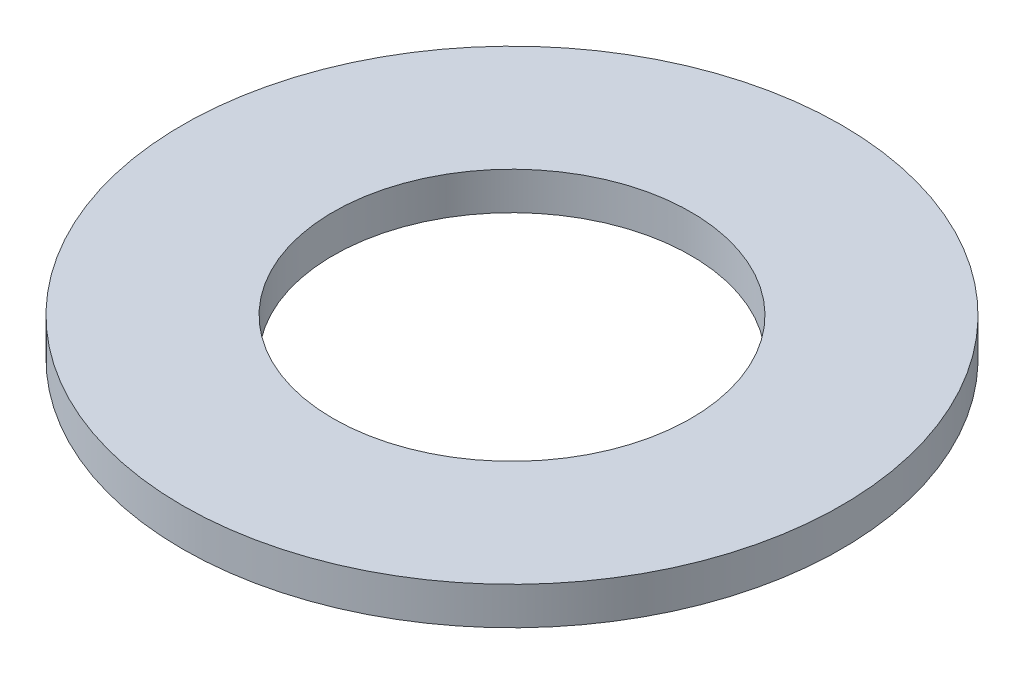
ISO-10303-21;
HEADER;
FILE_DESCRIPTION(('STEP AP214'),'2;1');
FILE_NAME('part.step','',(''),(''),'','','');
FILE_SCHEMA(('AUTOMOTIVE_DESIGN { 1 0 10303 214 1 1 1 1 }'));
ENDSEC;
DATA;
#1=APPLICATION_CONTEXT('core data for automotive mechanical design processes');
#2=APPLICATION_PROTOCOL_DEFINITION('international standard','automotive_design',2000,#1);
#3=PRODUCT_CONTEXT('',#1,'mechanical');
#4=PRODUCT('Part','Part','',(#3));
#5=PRODUCT_RELATED_PRODUCT_CATEGORY('part','',(#4));
#6=PRODUCT_DEFINITION_FORMATION('','',#4);
#7=PRODUCT_DEFINITION_CONTEXT('part definition',#1,'design');
#8=PRODUCT_DEFINITION('design','',#6,#7);
#9=PRODUCT_DEFINITION_SHAPE('','',#8);
#10=(LENGTH_UNIT() NAMED_UNIT(*) SI_UNIT(.MILLI.,.METRE.));
#11=(NAMED_UNIT(*) PLANE_ANGLE_UNIT() SI_UNIT($,.RADIAN.));
#12=(NAMED_UNIT(*) SI_UNIT($,.STERADIAN.) SOLID_ANGLE_UNIT());
#13=UNCERTAINTY_MEASURE_WITH_UNIT(LENGTH_MEASURE(1.E-05),#10,'distance_accuracy_value','');
#14=(GEOMETRIC_REPRESENTATION_CONTEXT(3) GLOBAL_UNCERTAINTY_ASSIGNED_CONTEXT((#13)) GLOBAL_UNIT_ASSIGNED_CONTEXT((#10,
#11,#12)) REPRESENTATION_CONTEXT('',''));
#15=CARTESIAN_POINT('',(0.,0.,0.));
#16=DIRECTION('',(0.,0.,1.));
#17=DIRECTION('',(1.,0.,0.));
#18=AXIS2_PLACEMENT_3D('',#15,#16,#17);
#19=CARTESIAN_POINT('',(0.,10.,0.));
#20=DIRECTION('',(0.,-1.,0.));
#21=DIRECTION('',(0.,0.,-1.));
#22=AXIS2_PLACEMENT_3D('',#19,#20,#21);
#23=CYLINDRICAL_SURFACE('',#22,87.5);
#24=CARTESIAN_POINT('',(0.,10.,0.));
#25=DIRECTION('',(0.,1.,0.));
#26=DIRECTION('',(0.,0.,1.));
#27=AXIS2_PLACEMENT_3D('',#24,#25,#26);
#28=CIRCLE('',#27,87.5);
#29=CARTESIAN_POINT('',(0.,10.,87.5));
#30=VERTEX_POINT('',#29);
#31=EDGE_CURVE('E10',#30,#30,#28,.T.);
#32=ORIENTED_EDGE('',*,*,#31,.F.);
#33=EDGE_LOOP('',(#32));
#34=FACE_BOUND('',#33,.T.);
#35=CARTESIAN_POINT('',(0.,0.,0.));
#36=DIRECTION('',(0.,1.,0.));
#37=DIRECTION('',(0.,0.,1.));
#38=AXIS2_PLACEMENT_3D('',#35,#36,#37);
#39=CIRCLE('',#38,87.5);
#40=CARTESIAN_POINT('',(0.,0.,87.5));
#41=VERTEX_POINT('',#40);
#42=EDGE_CURVE('E37',#41,#41,#39,.T.);
#43=ORIENTED_EDGE('',*,*,#42,.T.);
#44=EDGE_LOOP('',(#43));
#45=FACE_BOUND('',#44,.T.);
#46=ADVANCED_FACE('F40',(#34,#45),#23,.T.);
#47=CARTESIAN_POINT('',(0.,10.,0.));
#48=DIRECTION('',(0.,1.,0.));
#49=DIRECTION('',(0.,0.,1.));
#50=AXIS2_PLACEMENT_3D('',#47,#48,#49);
#51=PLANE('',#50);
#52=CARTESIAN_POINT('',(0.,10.,0.));
#53=DIRECTION('',(0.,1.,0.));
#54=DIRECTION('',(0.,0.,1.));
#55=AXIS2_PLACEMENT_3D('',#52,#53,#54);
#56=CIRCLE('',#55,47.5);
#57=CARTESIAN_POINT('',(0.,10.,47.5));
#58=VERTEX_POINT('',#57);
#59=EDGE_CURVE('E50',#58,#58,#56,.T.);
#60=ORIENTED_EDGE('',*,*,#59,.F.);
#61=EDGE_LOOP('',(#60));
#62=FACE_BOUND('',#61,.T.);
#63=ORIENTED_EDGE('',*,*,#31,.T.);
#64=EDGE_LOOP('',(#63));
#65=FACE_BOUND('',#64,.T.);
#66=ADVANCED_FACE('F59',(#62,#65),#51,.T.);
#67=CARTESIAN_POINT('',(0.,0.,0.));
#68=DIRECTION('',(0.,1.,0.));
#69=DIRECTION('',(0.,0.,1.));
#70=AXIS2_PLACEMENT_3D('',#67,#68,#69);
#71=PLANE('',#70);
#72=CARTESIAN_POINT('',(0.,0.,0.));
#73=DIRECTION('',(0.,1.,0.));
#74=DIRECTION('',(0.,0.,1.));
#75=AXIS2_PLACEMENT_3D('',#72,#73,#74);
#76=CIRCLE('',#75,47.5);
#77=CARTESIAN_POINT('',(0.,0.,47.5));
#78=VERTEX_POINT('',#77);
#79=EDGE_CURVE('E47',#78,#78,#76,.T.);
#80=ORIENTED_EDGE('',*,*,#79,.T.);
#81=EDGE_LOOP('',(#80));
#82=FACE_BOUND('',#81,.T.);
#83=ORIENTED_EDGE('',*,*,#42,.F.);
#84=EDGE_LOOP('',(#83));
#85=FACE_BOUND('',#84,.T.);
#86=ADVANCED_FACE('F58',(#82,#85),#71,.F.);
#87=CARTESIAN_POINT('',(0.,10.,0.));
#88=DIRECTION('',(0.,-1.,0.));
#89=DIRECTION('',(0.,0.,-1.));
#90=AXIS2_PLACEMENT_3D('',#87,#88,#89);
#91=CYLINDRICAL_SURFACE('',#90,47.5);
#92=ORIENTED_EDGE('',*,*,#59,.T.);
#93=EDGE_LOOP('',(#92));
#94=FACE_BOUND('',#93,.T.);
#95=ORIENTED_EDGE('',*,*,#79,.F.);
#96=EDGE_LOOP('',(#95));
#97=FACE_BOUND('',#96,.T.);
#98=ADVANCED_FACE('F54',(#94,#97),#91,.F.);
#99=CLOSED_SHELL('',(#46,#66,#86,#98));
#100=MANIFOLD_SOLID_BREP('B2',#99);
#101=ADVANCED_BREP_SHAPE_REPRESENTATION('',(#18,#100),#14);
#102=SHAPE_DEFINITION_REPRESENTATION(#9,#101);
ENDSEC;
END-ISO-10303-21;
